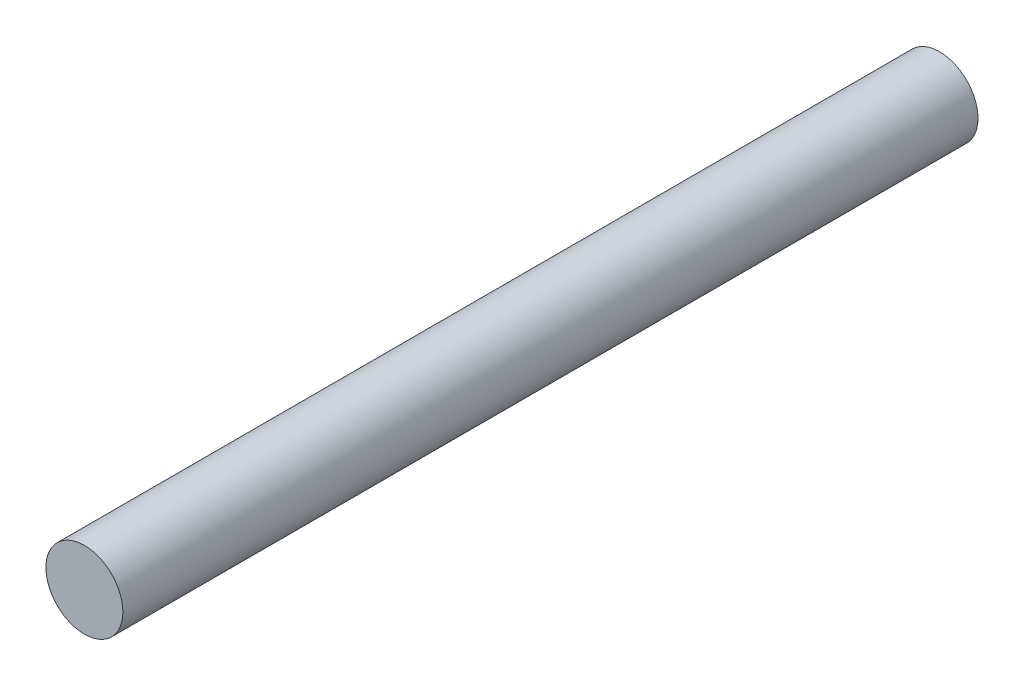
ISO-10303-21;
HEADER;
FILE_DESCRIPTION(('STEP AP214'),'2;1');
FILE_NAME('part.step','',(''),(''),'','','');
FILE_SCHEMA(('AUTOMOTIVE_DESIGN { 1 0 10303 214 1 1 1 1 }'));
ENDSEC;
DATA;
#1=APPLICATION_CONTEXT('core data for automotive mechanical design processes');
#2=APPLICATION_PROTOCOL_DEFINITION('international standard','automotive_design',2000,#1);
#3=PRODUCT_CONTEXT('',#1,'mechanical');
#4=PRODUCT('Part','Part','',(#3));
#5=PRODUCT_RELATED_PRODUCT_CATEGORY('part','',(#4));
#6=PRODUCT_DEFINITION_FORMATION('','',#4);
#7=PRODUCT_DEFINITION_CONTEXT('part definition',#1,'design');
#8=PRODUCT_DEFINITION('design','',#6,#7);
#9=PRODUCT_DEFINITION_SHAPE('','',#8);
#10=(LENGTH_UNIT() NAMED_UNIT(*) SI_UNIT(.MILLI.,.METRE.));
#11=(NAMED_UNIT(*) PLANE_ANGLE_UNIT() SI_UNIT($,.RADIAN.));
#12=(NAMED_UNIT(*) SI_UNIT($,.STERADIAN.) SOLID_ANGLE_UNIT());
#13=UNCERTAINTY_MEASURE_WITH_UNIT(LENGTH_MEASURE(1.E-05),#10,'distance_accuracy_value','');
#14=(GEOMETRIC_REPRESENTATION_CONTEXT(3) GLOBAL_UNCERTAINTY_ASSIGNED_CONTEXT((#13)) GLOBAL_UNIT_ASSIGNED_CONTEXT((#10,
#11,#12)) REPRESENTATION_CONTEXT('',''));
#15=CARTESIAN_POINT('',(0.,0.,0.));
#16=DIRECTION('',(0.,0.,1.));
#17=DIRECTION('',(1.,0.,0.));
#18=AXIS2_PLACEMENT_3D('',#15,#16,#17);
#19=CARTESIAN_POINT('',(0.,0.,100.));
#20=DIRECTION('',(0.,0.,-1.));
#21=DIRECTION('',(-1.,0.,0.));
#22=AXIS2_PLACEMENT_3D('',#19,#20,#21);
#23=CYLINDRICAL_SURFACE('',#22,4.5);
#24=CARTESIAN_POINT('',(0.,0.,100.));
#25=DIRECTION('',(0.,0.,1.));
#26=DIRECTION('',(1.,0.,0.));
#27=AXIS2_PLACEMENT_3D('',#24,#25,#26);
#28=CIRCLE('',#27,4.5);
#29=CARTESIAN_POINT('',(4.5,0.,100.));
#30=VERTEX_POINT('',#29);
#31=EDGE_CURVE('E10',#30,#30,#28,.T.);
#32=ORIENTED_EDGE('',*,*,#31,.F.);
#33=EDGE_LOOP('',(#32));
#34=FACE_BOUND('',#33,.T.);
#35=CARTESIAN_POINT('',(0.,0.,0.));
#36=DIRECTION('',(0.,0.,1.));
#37=DIRECTION('',(1.,0.,0.));
#38=AXIS2_PLACEMENT_3D('',#35,#36,#37);
#39=CIRCLE('',#38,4.5);
#40=CARTESIAN_POINT('',(4.5,0.,0.));
#41=VERTEX_POINT('',#40);
#42=EDGE_CURVE('E41',#41,#41,#39,.T.);
#43=ORIENTED_EDGE('',*,*,#42,.T.);
#44=EDGE_LOOP('',(#43));
#45=FACE_BOUND('',#44,.T.);
#46=ADVANCED_FACE('F38',(#34,#45),#23,.T.);
#47=CARTESIAN_POINT('',(0.,0.,100.));
#48=DIRECTION('',(0.,0.,1.));
#49=DIRECTION('',(1.,0.,0.));
#50=AXIS2_PLACEMENT_3D('',#47,#48,#49);
#51=PLANE('',#50);
#52=ORIENTED_EDGE('',*,*,#31,.T.);
#53=EDGE_LOOP('',(#52));
#54=FACE_BOUND('',#53,.T.);
#55=ADVANCED_FACE('F53',(#54),#51,.T.);
#56=CARTESIAN_POINT('',(0.,0.,0.));
#57=DIRECTION('',(0.,0.,1.));
#58=DIRECTION('',(1.,0.,0.));
#59=AXIS2_PLACEMENT_3D('',#56,#57,#58);
#60=PLANE('',#59);
#61=ORIENTED_EDGE('',*,*,#42,.F.);
#62=EDGE_LOOP('',(#61));
#63=FACE_BOUND('',#62,.T.);
#64=ADVANCED_FACE('F51',(#63),#60,.F.);
#65=CLOSED_SHELL('',(#46,#55,#64));
#66=MANIFOLD_SOLID_BREP('B2',#65);
#67=ADVANCED_BREP_SHAPE_REPRESENTATION('',(#18,#66),#14);
#68=SHAPE_DEFINITION_REPRESENTATION(#9,#67);
ENDSEC;
END-ISO-10303-21;
